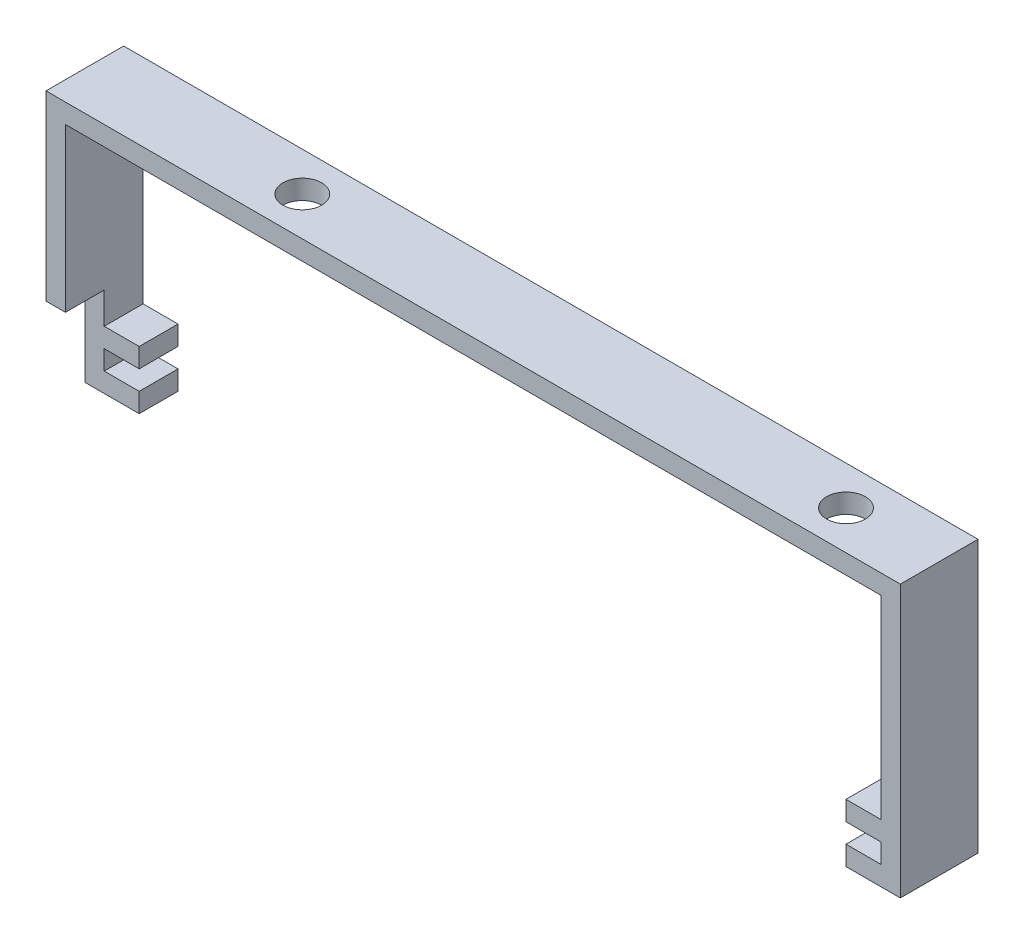
ISO-10303-21;
HEADER;
FILE_DESCRIPTION(('STEP AP214'),'2;1');
FILE_NAME('part.step','',(''),(''),'','','');
FILE_SCHEMA(('AUTOMOTIVE_DESIGN { 1 0 10303 214 1 1 1 1 }'));
ENDSEC;
DATA;
#1=APPLICATION_CONTEXT('core data for automotive mechanical design processes');
#2=APPLICATION_PROTOCOL_DEFINITION('international standard','automotive_design',2000,#1);
#3=PRODUCT_CONTEXT('',#1,'mechanical');
#4=PRODUCT('Part','Part','',(#3));
#5=PRODUCT_RELATED_PRODUCT_CATEGORY('part','',(#4));
#6=PRODUCT_DEFINITION_FORMATION('','',#4);
#7=PRODUCT_DEFINITION_CONTEXT('part definition',#1,'design');
#8=PRODUCT_DEFINITION('design','',#6,#7);
#9=PRODUCT_DEFINITION_SHAPE('','',#8);
#10=(LENGTH_UNIT() NAMED_UNIT(*) SI_UNIT(.MILLI.,.METRE.));
#11=(NAMED_UNIT(*) PLANE_ANGLE_UNIT() SI_UNIT($,.RADIAN.));
#12=(NAMED_UNIT(*) SI_UNIT($,.STERADIAN.) SOLID_ANGLE_UNIT());
#13=UNCERTAINTY_MEASURE_WITH_UNIT(LENGTH_MEASURE(1.E-05),#10,'distance_accuracy_value','');
#14=(GEOMETRIC_REPRESENTATION_CONTEXT(3) GLOBAL_UNCERTAINTY_ASSIGNED_CONTEXT((#13)) GLOBAL_UNIT_ASSIGNED_CONTEXT((#10,
#11,#12)) REPRESENTATION_CONTEXT('',''));
#15=CARTESIAN_POINT('',(0.,0.,0.));
#16=DIRECTION('',(0.,0.,1.));
#17=DIRECTION('',(1.,0.,0.));
#18=AXIS2_PLACEMENT_3D('',#15,#16,#17);
#19=CARTESIAN_POINT('',(0.,-32.5,10.));
#20=DIRECTION('',(1.,0.,0.));
#21=DIRECTION('',(0.,1.,0.));
#22=AXIS2_PLACEMENT_3D('',#19,#20,#21);
#23=PLANE('',#22);
#24=DIRECTION('',(0.,-1.,0.));
#25=VECTOR('',#24,1.);
#26=CARTESIAN_POINT('',(0.,-35.,5.));
#27=LINE('',#26,#25);
#28=CARTESIAN_POINT('',(0.,-23.4498932257555,5.));
#29=VERTEX_POINT('',#28);
#30=CARTESIAN_POINT('',(0.,-35.,5.));
#31=VERTEX_POINT('',#30);
#32=EDGE_CURVE('E343',#29,#31,#27,.T.);
#33=ORIENTED_EDGE('',*,*,#32,.F.);
#34=DIRECTION('',(0.,0.,1.));
#35=VECTOR('',#34,1.);
#36=CARTESIAN_POINT('',(0.,-23.4498932257555,5.));
#37=LINE('',#36,#35);
#38=CARTESIAN_POINT('',(0.,-23.4498932257555,10.));
#39=VERTEX_POINT('',#38);
#40=EDGE_CURVE('E335',#29,#39,#37,.T.);
#41=ORIENTED_EDGE('',*,*,#40,.T.);
#42=DIRECTION('',(0.,-1.,0.));
#43=VECTOR('',#42,1.);
#44=CARTESIAN_POINT('',(0.,0.,10.));
#45=LINE('',#44,#43);
#46=CARTESIAN_POINT('',(0.,0.,10.));
#47=VERTEX_POINT('',#46);
#48=EDGE_CURVE('E266',#47,#39,#45,.T.);
#49=ORIENTED_EDGE('',*,*,#48,.F.);
#50=DIRECTION('',(0.,0.,-1.));
#51=VECTOR('',#50,1.);
#52=CARTESIAN_POINT('',(0.,0.,10.));
#53=LINE('',#52,#51);
#54=CARTESIAN_POINT('',(0.,0.,0.));
#55=VERTEX_POINT('',#54);
#56=EDGE_CURVE('E196',#47,#55,#53,.T.);
#57=ORIENTED_EDGE('',*,*,#56,.T.);
#58=DIRECTION('',(0.,-1.,0.));
#59=VECTOR('',#58,1.);
#60=CARTESIAN_POINT('',(0.,-32.5,0.));
#61=LINE('',#60,#59);
#62=CARTESIAN_POINT('',(0.,-35.,0.));
#63=VERTEX_POINT('',#62);
#64=EDGE_CURVE('E132',#55,#63,#61,.T.);
#65=ORIENTED_EDGE('',*,*,#64,.T.);
#66=DIRECTION('',(0.,0.,-1.));
#67=VECTOR('',#66,1.);
#68=CARTESIAN_POINT('',(0.,-35.,10.));
#69=LINE('',#68,#67);
#70=EDGE_CURVE('E327',#31,#63,#69,.T.);
#71=ORIENTED_EDGE('',*,*,#70,.F.);
#72=EDGE_LOOP('',(#33,#41,#49,#57,#65,#71));
#73=FACE_BOUND('',#72,.T.);
#74=ADVANCED_FACE('F38',(#73),#23,.F.);
#75=CARTESIAN_POINT('',(0.,-35.,10.));
#76=DIRECTION('',(0.,1.,0.));
#77=DIRECTION('',(0.,0.,1.));
#78=AXIS2_PLACEMENT_3D('',#75,#76,#77);
#79=PLANE('',#78);
#80=DIRECTION('',(0.,0.,-1.));
#81=VECTOR('',#80,1.);
#82=CARTESIAN_POINT('',(7.,-35.,10.));
#83=LINE('',#82,#81);
#84=CARTESIAN_POINT('',(7.,-35.,5.));
#85=VERTEX_POINT('',#84);
#86=CARTESIAN_POINT('',(7.,-35.,0.));
#87=VERTEX_POINT('',#86);
#88=EDGE_CURVE('E324',#85,#87,#83,.T.);
#89=ORIENTED_EDGE('',*,*,#88,.F.);
#90=DIRECTION('',(1.,0.,0.));
#91=VECTOR('',#90,1.);
#92=CARTESIAN_POINT('',(0.,-35.,5.));
#93=LINE('',#92,#91);
#94=EDGE_CURVE('E396',#31,#85,#93,.T.);
#95=ORIENTED_EDGE('',*,*,#94,.F.);
#96=ORIENTED_EDGE('',*,*,#70,.T.);
#97=DIRECTION('',(1.,0.,0.));
#98=VECTOR('',#97,1.);
#99=CARTESIAN_POINT('',(0.,-35.,0.));
#100=LINE('',#99,#98);
#101=EDGE_CURVE('E202',#63,#87,#100,.T.);
#102=ORIENTED_EDGE('',*,*,#101,.T.);
#103=EDGE_LOOP('',(#89,#95,#96,#102));
#104=FACE_BOUND('',#103,.T.);
#105=ADVANCED_FACE('F392',(#104),#79,.F.);
#106=CARTESIAN_POINT('',(7.,-32.5,10.));
#107=DIRECTION('',(-1.,0.,0.));
#108=DIRECTION('',(0.,0.,1.));
#109=AXIS2_PLACEMENT_3D('',#106,#107,#108);
#110=PLANE('',#109);
#111=DIRECTION('',(0.,0.,-1.));
#112=VECTOR('',#111,1.);
#113=CARTESIAN_POINT('',(7.,-32.5,10.));
#114=LINE('',#113,#112);
#115=CARTESIAN_POINT('',(7.,-32.5,5.));
#116=VERTEX_POINT('',#115);
#117=CARTESIAN_POINT('',(7.,-32.5,0.));
#118=VERTEX_POINT('',#117);
#119=EDGE_CURVE('E321',#116,#118,#114,.T.);
#120=ORIENTED_EDGE('',*,*,#119,.F.);
#121=DIRECTION('',(0.,-1.,0.));
#122=VECTOR('',#121,1.);
#123=CARTESIAN_POINT('',(7.,-32.5,5.));
#124=LINE('',#123,#122);
#125=EDGE_CURVE('E203',#116,#85,#124,.T.);
#126=ORIENTED_EDGE('',*,*,#125,.T.);
#127=ORIENTED_EDGE('',*,*,#88,.T.);
#128=DIRECTION('',(0.,1.,0.));
#129=VECTOR('',#128,1.);
#130=CARTESIAN_POINT('',(7.,-32.5,0.));
#131=LINE('',#130,#129);
#132=EDGE_CURVE('E207',#87,#118,#131,.T.);
#133=ORIENTED_EDGE('',*,*,#132,.T.);
#134=EDGE_LOOP('',(#120,#126,#127,#133));
#135=FACE_BOUND('',#134,.T.);
#136=ADVANCED_FACE('F437',(#135),#110,.F.);
#137=CARTESIAN_POINT('',(2.5,-32.5,10.));
#138=DIRECTION('',(0.,-1.,0.));
#139=DIRECTION('',(0.,0.,-1.));
#140=AXIS2_PLACEMENT_3D('',#137,#138,#139);
#141=PLANE('',#140);
#142=DIRECTION('',(0.,0.,-1.));
#143=VECTOR('',#142,1.);
#144=CARTESIAN_POINT('',(2.5,-32.5,10.));
#145=LINE('',#144,#143);
#146=CARTESIAN_POINT('',(2.5,-32.5,5.));
#147=VERTEX_POINT('',#146);
#148=CARTESIAN_POINT('',(2.5,-32.5,0.));
#149=VERTEX_POINT('',#148);
#150=EDGE_CURVE('E318',#147,#149,#145,.T.);
#151=ORIENTED_EDGE('',*,*,#150,.F.);
#152=DIRECTION('',(1.,0.,0.));
#153=VECTOR('',#152,1.);
#154=CARTESIAN_POINT('',(2.5,-32.5,5.));
#155=LINE('',#154,#153);
#156=EDGE_CURVE('E428',#147,#116,#155,.T.);
#157=ORIENTED_EDGE('',*,*,#156,.T.);
#158=ORIENTED_EDGE('',*,*,#119,.T.);
#159=DIRECTION('',(-1.,0.,0.));
#160=VECTOR('',#159,1.);
#161=CARTESIAN_POINT('',(2.5,-32.5,0.));
#162=LINE('',#161,#160);
#163=EDGE_CURVE('E211',#118,#149,#162,.T.);
#164=ORIENTED_EDGE('',*,*,#163,.T.);
#165=EDGE_LOOP('',(#151,#157,#158,#164));
#166=FACE_BOUND('',#165,.T.);
#167=ADVANCED_FACE('F504',(#166),#141,.F.);
#168=CARTESIAN_POINT('',(2.5,-30.,10.));
#169=DIRECTION('',(-1.,0.,0.));
#170=DIRECTION('',(0.,0.,1.));
#171=AXIS2_PLACEMENT_3D('',#168,#169,#170);
#172=PLANE('',#171);
#173=DIRECTION('',(0.,0.,-1.));
#174=VECTOR('',#173,1.);
#175=CARTESIAN_POINT('',(2.5,-30.,10.));
#176=LINE('',#175,#174);
#177=CARTESIAN_POINT('',(2.5,-30.,5.));
#178=VERTEX_POINT('',#177);
#179=CARTESIAN_POINT('',(2.5,-30.,0.));
#180=VERTEX_POINT('',#179);
#181=EDGE_CURVE('E315',#178,#180,#176,.T.);
#182=ORIENTED_EDGE('',*,*,#181,.F.);
#183=DIRECTION('',(0.,-1.,0.));
#184=VECTOR('',#183,1.);
#185=CARTESIAN_POINT('',(2.5,-30.,5.));
#186=LINE('',#185,#184);
#187=EDGE_CURVE('E425',#178,#147,#186,.T.);
#188=ORIENTED_EDGE('',*,*,#187,.T.);
#189=ORIENTED_EDGE('',*,*,#150,.T.);
#190=DIRECTION('',(0.,1.,0.));
#191=VECTOR('',#190,1.);
#192=CARTESIAN_POINT('',(2.5,-30.,0.));
#193=LINE('',#192,#191);
#194=EDGE_CURVE('E215',#149,#180,#193,.T.);
#195=ORIENTED_EDGE('',*,*,#194,.T.);
#196=EDGE_LOOP('',(#182,#188,#189,#195));
#197=FACE_BOUND('',#196,.T.);
#198=ADVANCED_FACE('F503',(#197),#172,.F.);
#199=CARTESIAN_POINT('',(2.5,-30.,10.));
#200=DIRECTION('',(0.,1.,0.));
#201=DIRECTION('',(0.,0.,1.));
#202=AXIS2_PLACEMENT_3D('',#199,#200,#201);
#203=PLANE('',#202);
#204=DIRECTION('',(0.,0.,-1.));
#205=VECTOR('',#204,1.);
#206=CARTESIAN_POINT('',(7.,-30.,10.));
#207=LINE('',#206,#205);
#208=CARTESIAN_POINT('',(7.,-30.,5.));
#209=VERTEX_POINT('',#208);
#210=CARTESIAN_POINT('',(7.,-30.,0.));
#211=VERTEX_POINT('',#210);
#212=EDGE_CURVE('E312',#209,#211,#207,.T.);
#213=ORIENTED_EDGE('',*,*,#212,.F.);
#214=DIRECTION('',(-1.,0.,0.));
#215=VECTOR('',#214,1.);
#216=CARTESIAN_POINT('',(2.5,-30.,5.));
#217=LINE('',#216,#215);
#218=EDGE_CURVE('E421',#209,#178,#217,.T.);
#219=ORIENTED_EDGE('',*,*,#218,.T.);
#220=ORIENTED_EDGE('',*,*,#181,.T.);
#221=DIRECTION('',(1.,0.,0.));
#222=VECTOR('',#221,1.);
#223=CARTESIAN_POINT('',(2.5,-30.,0.));
#224=LINE('',#223,#222);
#225=EDGE_CURVE('E219',#180,#211,#224,.T.);
#226=ORIENTED_EDGE('',*,*,#225,.T.);
#227=EDGE_LOOP('',(#213,#219,#220,#226));
#228=FACE_BOUND('',#227,.T.);
#229=ADVANCED_FACE('F499',(#228),#203,.F.);
#230=CARTESIAN_POINT('',(7.,-30.,10.));
#231=DIRECTION('',(-1.,0.,0.));
#232=DIRECTION('',(0.,0.,1.));
#233=AXIS2_PLACEMENT_3D('',#230,#231,#232);
#234=PLANE('',#233);
#235=DIRECTION('',(0.,0.,-1.));
#236=VECTOR('',#235,1.);
#237=CARTESIAN_POINT('',(7.,-27.5,10.));
#238=LINE('',#237,#236);
#239=CARTESIAN_POINT('',(7.,-27.5,5.));
#240=VERTEX_POINT('',#239);
#241=CARTESIAN_POINT('',(7.,-27.5,0.));
#242=VERTEX_POINT('',#241);
#243=EDGE_CURVE('E309',#240,#242,#238,.T.);
#244=ORIENTED_EDGE('',*,*,#243,.F.);
#245=DIRECTION('',(0.,-1.,0.));
#246=VECTOR('',#245,1.);
#247=CARTESIAN_POINT('',(7.,-30.,5.));
#248=LINE('',#247,#246);
#249=EDGE_CURVE('E417',#240,#209,#248,.T.);
#250=ORIENTED_EDGE('',*,*,#249,.T.);
#251=ORIENTED_EDGE('',*,*,#212,.T.);
#252=DIRECTION('',(0.,1.,0.));
#253=VECTOR('',#252,1.);
#254=CARTESIAN_POINT('',(7.,-30.,0.));
#255=LINE('',#254,#253);
#256=EDGE_CURVE('E223',#211,#242,#255,.T.);
#257=ORIENTED_EDGE('',*,*,#256,.T.);
#258=EDGE_LOOP('',(#244,#250,#251,#257));
#259=FACE_BOUND('',#258,.T.);
#260=ADVANCED_FACE('F496',(#259),#234,.F.);
#261=CARTESIAN_POINT('',(2.5,-27.5,10.));
#262=DIRECTION('',(0.,-1.,0.));
#263=DIRECTION('',(0.,0.,-1.));
#264=AXIS2_PLACEMENT_3D('',#261,#262,#263);
#265=PLANE('',#264);
#266=DIRECTION('',(0.,0.,-1.));
#267=VECTOR('',#266,1.);
#268=CARTESIAN_POINT('',(2.5,-27.5,10.));
#269=LINE('',#268,#267);
#270=CARTESIAN_POINT('',(2.5,-27.5,5.));
#271=VERTEX_POINT('',#270);
#272=CARTESIAN_POINT('',(2.5,-27.5,0.));
#273=VERTEX_POINT('',#272);
#274=EDGE_CURVE('E306',#271,#273,#269,.T.);
#275=ORIENTED_EDGE('',*,*,#274,.F.);
#276=DIRECTION('',(1.,0.,0.));
#277=VECTOR('',#276,1.);
#278=CARTESIAN_POINT('',(2.5,-27.5,5.));
#279=LINE('',#278,#277);
#280=EDGE_CURVE('E413',#271,#240,#279,.T.);
#281=ORIENTED_EDGE('',*,*,#280,.T.);
#282=ORIENTED_EDGE('',*,*,#243,.T.);
#283=DIRECTION('',(-1.,0.,0.));
#284=VECTOR('',#283,1.);
#285=CARTESIAN_POINT('',(2.5,-27.5,0.));
#286=LINE('',#285,#284);
#287=EDGE_CURVE('E227',#242,#273,#286,.T.);
#288=ORIENTED_EDGE('',*,*,#287,.T.);
#289=EDGE_LOOP('',(#275,#281,#282,#288));
#290=FACE_BOUND('',#289,.T.);
#291=ADVANCED_FACE('F493',(#290),#265,.F.);
#292=CARTESIAN_POINT('',(2.5,-2.5,10.));
#293=DIRECTION('',(-1.,0.,0.));
#294=DIRECTION('',(0.,-1.,0.));
#295=AXIS2_PLACEMENT_3D('',#292,#293,#294);
#296=PLANE('',#295);
#297=DIRECTION('',(0.,1.,0.));
#298=VECTOR('',#297,1.);
#299=CARTESIAN_POINT('',(2.5,-2.5,10.));
#300=LINE('',#299,#298);
#301=CARTESIAN_POINT('',(2.5,-23.4498932257555,10.));
#302=VERTEX_POINT('',#301);
#303=CARTESIAN_POINT('',(2.5,-2.5,10.));
#304=VERTEX_POINT('',#303);
#305=EDGE_CURVE('E139',#302,#304,#300,.T.);
#306=ORIENTED_EDGE('',*,*,#305,.F.);
#307=DIRECTION('',(0.,0.,-1.));
#308=VECTOR('',#307,1.);
#309=CARTESIAN_POINT('',(2.5,-23.4498932257555,10.));
#310=LINE('',#309,#308);
#311=CARTESIAN_POINT('',(2.5,-23.4498932257555,5.));
#312=VERTEX_POINT('',#311);
#313=EDGE_CURVE('E53',#302,#312,#310,.T.);
#314=ORIENTED_EDGE('',*,*,#313,.T.);
#315=DIRECTION('',(0.,-1.,0.));
#316=VECTOR('',#315,1.);
#317=CARTESIAN_POINT('',(2.5,-2.5,5.));
#318=LINE('',#317,#316);
#319=EDGE_CURVE('E11',#312,#271,#318,.T.);
#320=ORIENTED_EDGE('',*,*,#319,.T.);
#321=ORIENTED_EDGE('',*,*,#274,.T.);
#322=DIRECTION('',(0.,1.,0.));
#323=VECTOR('',#322,1.);
#324=CARTESIAN_POINT('',(2.5,-2.5,0.));
#325=LINE('',#324,#323);
#326=CARTESIAN_POINT('',(2.5,-2.5,0.));
#327=VERTEX_POINT('',#326);
#328=EDGE_CURVE('E231',#273,#327,#325,.T.);
#329=ORIENTED_EDGE('',*,*,#328,.T.);
#330=DIRECTION('',(0.,0.,-1.));
#331=VECTOR('',#330,1.);
#332=CARTESIAN_POINT('',(2.5,-2.5,10.));
#333=LINE('',#332,#331);
#334=EDGE_CURVE('E302',#304,#327,#333,.T.);
#335=ORIENTED_EDGE('',*,*,#334,.F.);
#336=EDGE_LOOP('',(#306,#314,#320,#321,#329,#335));
#337=FACE_BOUND('',#336,.T.);
#338=ADVANCED_FACE('F458',(#337),#296,.F.);
#339=CARTESIAN_POINT('',(2.5,-2.5,10.));
#340=DIRECTION('',(0.,1.,0.));
#341=DIRECTION('',(-1.,0.,0.));
#342=AXIS2_PLACEMENT_3D('',#339,#340,#341);
#343=PLANE('',#342);
#344=CARTESIAN_POINT('',(98.,-2.5,5.));
#345=DIRECTION('',(0.,1.,0.));
#346=DIRECTION('',(-1.,0.,0.));
#347=AXIS2_PLACEMENT_3D('',#344,#345,#346);
#348=CIRCLE('',#347,2.5);
#349=CARTESIAN_POINT('',(95.5,-2.5,5.));
#350=VERTEX_POINT('',#349);
#351=EDGE_CURVE('E407',#350,#350,#348,.T.);
#352=ORIENTED_EDGE('',*,*,#351,.T.);
#353=EDGE_LOOP('',(#352));
#354=FACE_BOUND('',#353,.T.);
#355=CARTESIAN_POINT('',(28.,-2.5,5.));
#356=DIRECTION('',(0.,1.,0.));
#357=DIRECTION('',(-1.,0.,0.));
#358=AXIS2_PLACEMENT_3D('',#355,#356,#357);
#359=CIRCLE('',#358,2.50000000000001);
#360=CARTESIAN_POINT('',(25.5,-2.5,5.));
#361=VERTEX_POINT('',#360);
#362=EDGE_CURVE('E700',#361,#361,#359,.T.);
#363=ORIENTED_EDGE('',*,*,#362,.T.);
#364=EDGE_LOOP('',(#363));
#365=FACE_BOUND('',#364,.T.);
#366=DIRECTION('',(1.,0.,0.));
#367=VECTOR('',#366,1.);
#368=CARTESIAN_POINT('',(2.5,-2.5,0.));
#369=LINE('',#368,#367);
#370=CARTESIAN_POINT('',(107.5,-2.5,0.));
#371=VERTEX_POINT('',#370);
#372=EDGE_CURVE('E234',#327,#371,#369,.T.);
#373=ORIENTED_EDGE('',*,*,#372,.T.);
#374=DIRECTION('',(0.,0.,-1.));
#375=VECTOR('',#374,1.);
#376=CARTESIAN_POINT('',(107.5,-2.5,10.));
#377=LINE('',#376,#375);
#378=CARTESIAN_POINT('',(107.5,-2.5,10.));
#379=VERTEX_POINT('',#378);
#380=EDGE_CURVE('E298',#379,#371,#377,.T.);
#381=ORIENTED_EDGE('',*,*,#380,.F.);
#382=DIRECTION('',(1.,0.,0.));
#383=VECTOR('',#382,1.);
#384=CARTESIAN_POINT('',(2.5,-2.5,10.));
#385=LINE('',#384,#383);
#386=EDGE_CURVE('E350',#304,#379,#385,.T.);
#387=ORIENTED_EDGE('',*,*,#386,.F.);
#388=ORIENTED_EDGE('',*,*,#334,.T.);
#389=EDGE_LOOP('',(#373,#381,#387,#388));
#390=FACE_BOUND('',#389,.T.);
#391=ADVANCED_FACE('F465',(#354,#365,#390),#343,.F.);
#392=CARTESIAN_POINT('',(107.5,-2.5,10.));
#393=DIRECTION('',(1.,0.,0.));
#394=DIRECTION('',(0.,1.,0.));
#395=AXIS2_PLACEMENT_3D('',#392,#393,#394);
#396=PLANE('',#395);
#397=DIRECTION('',(0.,-1.,0.));
#398=VECTOR('',#397,1.);
#399=CARTESIAN_POINT('',(107.5,-2.5,0.));
#400=LINE('',#399,#398);
#401=CARTESIAN_POINT('',(107.5,-27.5,0.));
#402=VERTEX_POINT('',#401);
#403=EDGE_CURVE('E237',#371,#402,#400,.T.);
#404=ORIENTED_EDGE('',*,*,#403,.T.);
#405=DIRECTION('',(0.,0.,-1.));
#406=VECTOR('',#405,1.);
#407=CARTESIAN_POINT('',(107.5,-27.5,10.));
#408=LINE('',#407,#406);
#409=CARTESIAN_POINT('',(107.5,-27.5,10.));
#410=VERTEX_POINT('',#409);
#411=EDGE_CURVE('E294',#410,#402,#408,.T.);
#412=ORIENTED_EDGE('',*,*,#411,.F.);
#413=DIRECTION('',(0.,-1.,0.));
#414=VECTOR('',#413,1.);
#415=CARTESIAN_POINT('',(107.5,-2.5,10.));
#416=LINE('',#415,#414);
#417=EDGE_CURVE('E357',#379,#410,#416,.T.);
#418=ORIENTED_EDGE('',*,*,#417,.F.);
#419=ORIENTED_EDGE('',*,*,#380,.T.);
#420=EDGE_LOOP('',(#404,#412,#418,#419));
#421=FACE_BOUND('',#420,.T.);
#422=ADVANCED_FACE('F471',(#421),#396,.F.);
#423=CARTESIAN_POINT('',(107.5,-27.5,10.));
#424=DIRECTION('',(0.,-1.,0.));
#425=DIRECTION('',(0.,0.,-1.));
#426=AXIS2_PLACEMENT_3D('',#423,#424,#425);
#427=PLANE('',#426);
#428=DIRECTION('',(-1.,0.,0.));
#429=VECTOR('',#428,1.);
#430=CARTESIAN_POINT('',(107.5,-27.5,0.));
#431=LINE('',#430,#429);
#432=CARTESIAN_POINT('',(103.,-27.5,0.));
#433=VERTEX_POINT('',#432);
#434=EDGE_CURVE('E240',#402,#433,#431,.T.);
#435=ORIENTED_EDGE('',*,*,#434,.T.);
#436=DIRECTION('',(0.,0.,-1.));
#437=VECTOR('',#436,1.);
#438=CARTESIAN_POINT('',(103.,-27.5,10.));
#439=LINE('',#438,#437);
#440=CARTESIAN_POINT('',(103.,-27.5,10.));
#441=VERTEX_POINT('',#440);
#442=EDGE_CURVE('E290',#441,#433,#439,.T.);
#443=ORIENTED_EDGE('',*,*,#442,.F.);
#444=DIRECTION('',(-1.,0.,0.));
#445=VECTOR('',#444,1.);
#446=CARTESIAN_POINT('',(107.5,-27.5,10.));
#447=LINE('',#446,#445);
#448=EDGE_CURVE('E360',#410,#441,#447,.T.);
#449=ORIENTED_EDGE('',*,*,#448,.F.);
#450=ORIENTED_EDGE('',*,*,#411,.T.);
#451=EDGE_LOOP('',(#435,#443,#449,#450));
#452=FACE_BOUND('',#451,.T.);
#453=ADVANCED_FACE('F475',(#452),#427,.F.);
#454=CARTESIAN_POINT('',(103.,-27.5,10.));
#455=DIRECTION('',(1.,0.,0.));
#456=DIRECTION('',(0.,0.,-1.));
#457=AXIS2_PLACEMENT_3D('',#454,#455,#456);
#458=PLANE('',#457);
#459=DIRECTION('',(0.,-1.,0.));
#460=VECTOR('',#459,1.);
#461=CARTESIAN_POINT('',(103.,-27.5,0.));
#462=LINE('',#461,#460);
#463=CARTESIAN_POINT('',(103.,-30.,0.));
#464=VERTEX_POINT('',#463);
#465=EDGE_CURVE('E243',#433,#464,#462,.T.);
#466=ORIENTED_EDGE('',*,*,#465,.T.);
#467=DIRECTION('',(0.,0.,-1.));
#468=VECTOR('',#467,1.);
#469=CARTESIAN_POINT('',(103.,-30.,10.));
#470=LINE('',#469,#468);
#471=CARTESIAN_POINT('',(103.,-30.,10.));
#472=VERTEX_POINT('',#471);
#473=EDGE_CURVE('E286',#472,#464,#470,.T.);
#474=ORIENTED_EDGE('',*,*,#473,.F.);
#475=DIRECTION('',(0.,-1.,0.));
#476=VECTOR('',#475,1.);
#477=CARTESIAN_POINT('',(103.,-27.5,10.));
#478=LINE('',#477,#476);
#479=EDGE_CURVE('E363',#441,#472,#478,.T.);
#480=ORIENTED_EDGE('',*,*,#479,.F.);
#481=ORIENTED_EDGE('',*,*,#442,.T.);
#482=EDGE_LOOP('',(#466,#474,#480,#481));
#483=FACE_BOUND('',#482,.T.);
#484=ADVANCED_FACE('F480',(#483),#458,.F.);
#485=CARTESIAN_POINT('',(107.5,-30.,10.));
#486=DIRECTION('',(0.,1.,0.));
#487=DIRECTION('',(0.,0.,1.));
#488=AXIS2_PLACEMENT_3D('',#485,#486,#487);
#489=PLANE('',#488);
#490=DIRECTION('',(1.,0.,0.));
#491=VECTOR('',#490,1.);
#492=CARTESIAN_POINT('',(107.5,-30.,0.));
#493=LINE('',#492,#491);
#494=CARTESIAN_POINT('',(107.5,-30.,0.));
#495=VERTEX_POINT('',#494);
#496=EDGE_CURVE('E246',#464,#495,#493,.T.);
#497=ORIENTED_EDGE('',*,*,#496,.T.);
#498=DIRECTION('',(0.,0.,-1.));
#499=VECTOR('',#498,1.);
#500=CARTESIAN_POINT('',(107.5,-30.,10.));
#501=LINE('',#500,#499);
#502=CARTESIAN_POINT('',(107.5,-30.,10.));
#503=VERTEX_POINT('',#502);
#504=EDGE_CURVE('E282',#503,#495,#501,.T.);
#505=ORIENTED_EDGE('',*,*,#504,.F.);
#506=DIRECTION('',(1.,0.,0.));
#507=VECTOR('',#506,1.);
#508=CARTESIAN_POINT('',(107.5,-30.,10.));
#509=LINE('',#508,#507);
#510=EDGE_CURVE('E366',#472,#503,#509,.T.);
#511=ORIENTED_EDGE('',*,*,#510,.F.);
#512=ORIENTED_EDGE('',*,*,#473,.T.);
#513=EDGE_LOOP('',(#497,#505,#511,#512));
#514=FACE_BOUND('',#513,.T.);
#515=ADVANCED_FACE('F484',(#514),#489,.F.);
#516=CARTESIAN_POINT('',(107.5,-30.,10.));
#517=DIRECTION('',(1.,0.,0.));
#518=DIRECTION('',(0.,0.,-1.));
#519=AXIS2_PLACEMENT_3D('',#516,#517,#518);
#520=PLANE('',#519);
#521=DIRECTION('',(0.,-1.,0.));
#522=VECTOR('',#521,1.);
#523=CARTESIAN_POINT('',(107.5,-30.,0.));
#524=LINE('',#523,#522);
#525=CARTESIAN_POINT('',(107.5,-32.5,0.));
#526=VERTEX_POINT('',#525);
#527=EDGE_CURVE('E249',#495,#526,#524,.T.);
#528=ORIENTED_EDGE('',*,*,#527,.T.);
#529=DIRECTION('',(0.,0.,-1.));
#530=VECTOR('',#529,1.);
#531=CARTESIAN_POINT('',(107.5,-32.5,10.));
#532=LINE('',#531,#530);
#533=CARTESIAN_POINT('',(107.5,-32.5,10.));
#534=VERTEX_POINT('',#533);
#535=EDGE_CURVE('E278',#534,#526,#532,.T.);
#536=ORIENTED_EDGE('',*,*,#535,.F.);
#537=DIRECTION('',(0.,-1.,0.));
#538=VECTOR('',#537,1.);
#539=CARTESIAN_POINT('',(107.5,-30.,10.));
#540=LINE('',#539,#538);
#541=EDGE_CURVE('E369',#503,#534,#540,.T.);
#542=ORIENTED_EDGE('',*,*,#541,.F.);
#543=ORIENTED_EDGE('',*,*,#504,.T.);
#544=EDGE_LOOP('',(#528,#536,#542,#543));
#545=FACE_BOUND('',#544,.T.);
#546=ADVANCED_FACE('F488',(#545),#520,.F.);
#547=CARTESIAN_POINT('',(107.5,-32.5,10.));
#548=DIRECTION('',(0.,-1.,0.));
#549=DIRECTION('',(0.,0.,-1.));
#550=AXIS2_PLACEMENT_3D('',#547,#548,#549);
#551=PLANE('',#550);
#552=DIRECTION('',(-1.,0.,0.));
#553=VECTOR('',#552,1.);
#554=CARTESIAN_POINT('',(107.5,-32.5,0.));
#555=LINE('',#554,#553);
#556=CARTESIAN_POINT('',(103.,-32.5,0.));
#557=VERTEX_POINT('',#556);
#558=EDGE_CURVE('E252',#526,#557,#555,.T.);
#559=ORIENTED_EDGE('',*,*,#558,.T.);
#560=DIRECTION('',(0.,0.,-1.));
#561=VECTOR('',#560,1.);
#562=CARTESIAN_POINT('',(103.,-32.5,10.));
#563=LINE('',#562,#561);
#564=CARTESIAN_POINT('',(103.,-32.5,10.));
#565=VERTEX_POINT('',#564);
#566=EDGE_CURVE('E274',#565,#557,#563,.T.);
#567=ORIENTED_EDGE('',*,*,#566,.F.);
#568=DIRECTION('',(-1.,0.,0.));
#569=VECTOR('',#568,1.);
#570=CARTESIAN_POINT('',(107.5,-32.5,10.));
#571=LINE('',#570,#569);
#572=EDGE_CURVE('E372',#534,#565,#571,.T.);
#573=ORIENTED_EDGE('',*,*,#572,.F.);
#574=ORIENTED_EDGE('',*,*,#535,.T.);
#575=EDGE_LOOP('',(#559,#567,#573,#574));
#576=FACE_BOUND('',#575,.T.);
#577=ADVANCED_FACE('F380',(#576),#551,.F.);
#578=CARTESIAN_POINT('',(103.,-32.5,10.));
#579=DIRECTION('',(1.,0.,0.));
#580=DIRECTION('',(0.,0.,-1.));
#581=AXIS2_PLACEMENT_3D('',#578,#579,#580);
#582=PLANE('',#581);
#583=DIRECTION('',(0.,-1.,0.));
#584=VECTOR('',#583,1.);
#585=CARTESIAN_POINT('',(103.,-32.5,0.));
#586=LINE('',#585,#584);
#587=CARTESIAN_POINT('',(103.,-35.,0.));
#588=VERTEX_POINT('',#587);
#589=EDGE_CURVE('E255',#557,#588,#586,.T.);
#590=ORIENTED_EDGE('',*,*,#589,.T.);
#591=DIRECTION('',(0.,0.,-1.));
#592=VECTOR('',#591,1.);
#593=CARTESIAN_POINT('',(103.,-35.,10.));
#594=LINE('',#593,#592);
#595=CARTESIAN_POINT('',(103.,-35.,10.));
#596=VERTEX_POINT('',#595);
#597=EDGE_CURVE('E188',#596,#588,#594,.T.);
#598=ORIENTED_EDGE('',*,*,#597,.F.);
#599=DIRECTION('',(0.,-1.,0.));
#600=VECTOR('',#599,1.);
#601=CARTESIAN_POINT('',(103.,-32.5,10.));
#602=LINE('',#601,#600);
#603=EDGE_CURVE('E174',#565,#596,#602,.T.);
#604=ORIENTED_EDGE('',*,*,#603,.F.);
#605=ORIENTED_EDGE('',*,*,#566,.T.);
#606=EDGE_LOOP('',(#590,#598,#604,#605));
#607=FACE_BOUND('',#606,.T.);
#608=ADVANCED_FACE('F384',(#607),#582,.F.);
#609=CARTESIAN_POINT('',(110.,-35.,10.));
#610=DIRECTION('',(0.,1.,0.));
#611=DIRECTION('',(0.,0.,1.));
#612=AXIS2_PLACEMENT_3D('',#609,#610,#611);
#613=PLANE('',#612);
#614=DIRECTION('',(1.,0.,0.));
#615=VECTOR('',#614,1.);
#616=CARTESIAN_POINT('',(110.,-35.,0.));
#617=LINE('',#616,#615);
#618=CARTESIAN_POINT('',(110.,-35.,0.));
#619=VERTEX_POINT('',#618);
#620=EDGE_CURVE('E185',#588,#619,#617,.T.);
#621=ORIENTED_EDGE('',*,*,#620,.T.);
#622=DIRECTION('',(0.,0.,-1.));
#623=VECTOR('',#622,1.);
#624=CARTESIAN_POINT('',(110.,-35.,10.));
#625=LINE('',#624,#623);
#626=CARTESIAN_POINT('',(110.,-35.,10.));
#627=VERTEX_POINT('',#626);
#628=EDGE_CURVE('E182',#627,#619,#625,.T.);
#629=ORIENTED_EDGE('',*,*,#628,.F.);
#630=DIRECTION('',(1.,0.,0.));
#631=VECTOR('',#630,1.);
#632=CARTESIAN_POINT('',(110.,-35.,10.));
#633=LINE('',#632,#631);
#634=EDGE_CURVE('E167',#596,#627,#633,.T.);
#635=ORIENTED_EDGE('',*,*,#634,.F.);
#636=ORIENTED_EDGE('',*,*,#597,.T.);
#637=EDGE_LOOP('',(#621,#629,#635,#636));
#638=FACE_BOUND('',#637,.T.);
#639=ADVANCED_FACE('F183',(#638),#613,.F.);
#640=CARTESIAN_POINT('',(110.,0.,10.));
#641=DIRECTION('',(-1.,0.,0.));
#642=DIRECTION('',(0.,0.,1.));
#643=AXIS2_PLACEMENT_3D('',#640,#641,#642);
#644=PLANE('',#643);
#645=DIRECTION('',(0.,1.,0.));
#646=VECTOR('',#645,1.);
#647=CARTESIAN_POINT('',(110.,0.,0.));
#648=LINE('',#647,#646);
#649=CARTESIAN_POINT('',(110.,0.,0.));
#650=VERTEX_POINT('',#649);
#651=EDGE_CURVE('E260',#619,#650,#648,.T.);
#652=ORIENTED_EDGE('',*,*,#651,.T.);
#653=DIRECTION('',(0.,0.,-1.));
#654=VECTOR('',#653,1.);
#655=CARTESIAN_POINT('',(110.,0.,10.));
#656=LINE('',#655,#654);
#657=CARTESIAN_POINT('',(110.,0.,10.));
#658=VERTEX_POINT('',#657);
#659=EDGE_CURVE('E189',#658,#650,#656,.T.);
#660=ORIENTED_EDGE('',*,*,#659,.F.);
#661=DIRECTION('',(0.,1.,0.));
#662=VECTOR('',#661,1.);
#663=CARTESIAN_POINT('',(110.,-32.5,10.));
#664=LINE('',#663,#662);
#665=EDGE_CURVE('E171',#627,#658,#664,.T.);
#666=ORIENTED_EDGE('',*,*,#665,.F.);
#667=ORIENTED_EDGE('',*,*,#628,.T.);
#668=EDGE_LOOP('',(#652,#660,#666,#667));
#669=FACE_BOUND('',#668,.T.);
#670=ADVANCED_FACE('F191',(#669),#644,.F.);
#671=CARTESIAN_POINT('',(0.,0.,10.));
#672=DIRECTION('',(0.,-1.,0.));
#673=DIRECTION('',(0.,0.,-1.));
#674=AXIS2_PLACEMENT_3D('',#671,#672,#673);
#675=PLANE('',#674);
#676=CARTESIAN_POINT('',(98.,0.,5.));
#677=DIRECTION('',(0.,1.,0.));
#678=DIRECTION('',(0.,0.,1.));
#679=AXIS2_PLACEMENT_3D('',#676,#677,#678);
#680=CIRCLE('',#679,2.5);
#681=CARTESIAN_POINT('',(98.,0.,7.5));
#682=VERTEX_POINT('',#681);
#683=EDGE_CURVE('E696',#682,#682,#680,.T.);
#684=ORIENTED_EDGE('',*,*,#683,.F.);
#685=EDGE_LOOP('',(#684));
#686=FACE_BOUND('',#685,.T.);
#687=CARTESIAN_POINT('',(28.,0.,5.));
#688=DIRECTION('',(0.,1.,0.));
#689=DIRECTION('',(0.,0.,1.));
#690=AXIS2_PLACEMENT_3D('',#687,#688,#689);
#691=CIRCLE('',#690,2.50000000000001);
#692=CARTESIAN_POINT('',(28.,0.,7.50000000000001));
#693=VERTEX_POINT('',#692);
#694=EDGE_CURVE('E705',#693,#693,#691,.T.);
#695=ORIENTED_EDGE('',*,*,#694,.F.);
#696=EDGE_LOOP('',(#695));
#697=FACE_BOUND('',#696,.T.);
#698=DIRECTION('',(-1.,0.,0.));
#699=VECTOR('',#698,1.);
#700=CARTESIAN_POINT('',(0.,0.,0.));
#701=LINE('',#700,#699);
#702=EDGE_CURVE('E263',#650,#55,#701,.T.);
#703=ORIENTED_EDGE('',*,*,#702,.T.);
#704=ORIENTED_EDGE('',*,*,#56,.F.);
#705=DIRECTION('',(-1.,0.,0.));
#706=VECTOR('',#705,1.);
#707=CARTESIAN_POINT('',(0.,0.,10.));
#708=LINE('',#707,#706);
#709=EDGE_CURVE('E62',#658,#47,#708,.T.);
#710=ORIENTED_EDGE('',*,*,#709,.F.);
#711=ORIENTED_EDGE('',*,*,#659,.T.);
#712=EDGE_LOOP('',(#703,#704,#710,#711));
#713=FACE_BOUND('',#712,.T.);
#714=ADVANCED_FACE('F387',(#686,#697,#713),#675,.F.);
#715=CARTESIAN_POINT('',(0.,0.,10.));
#716=DIRECTION('',(0.,0.,1.));
#717=DIRECTION('',(1.,0.,0.));
#718=AXIS2_PLACEMENT_3D('',#715,#716,#717);
#719=PLANE('',#718);
#720=DIRECTION('',(-1.,0.,0.));
#721=VECTOR('',#720,1.);
#722=CARTESIAN_POINT('',(0.,-23.4498932257555,10.));
#723=LINE('',#722,#721);
#724=EDGE_CURVE('E46',#302,#39,#723,.T.);
#725=ORIENTED_EDGE('',*,*,#724,.F.);
#726=ORIENTED_EDGE('',*,*,#305,.T.);
#727=ORIENTED_EDGE('',*,*,#386,.T.);
#728=ORIENTED_EDGE('',*,*,#417,.T.);
#729=ORIENTED_EDGE('',*,*,#448,.T.);
#730=ORIENTED_EDGE('',*,*,#479,.T.);
#731=ORIENTED_EDGE('',*,*,#510,.T.);
#732=ORIENTED_EDGE('',*,*,#541,.T.);
#733=ORIENTED_EDGE('',*,*,#572,.T.);
#734=ORIENTED_EDGE('',*,*,#603,.T.);
#735=ORIENTED_EDGE('',*,*,#634,.T.);
#736=ORIENTED_EDGE('',*,*,#665,.T.);
#737=ORIENTED_EDGE('',*,*,#709,.T.);
#738=ORIENTED_EDGE('',*,*,#48,.T.);
#739=EDGE_LOOP('',(#725,#726,#727,#728,#729,#730,#731,#732,#733,#734,#735,#736,#737,#738));
#740=FACE_BOUND('',#739,.T.);
#741=ADVANCED_FACE('F169',(#740),#719,.T.);
#742=CARTESIAN_POINT('',(0.,0.,0.));
#743=DIRECTION('',(0.,0.,1.));
#744=DIRECTION('',(1.,0.,0.));
#745=AXIS2_PLACEMENT_3D('',#742,#743,#744);
#746=PLANE('',#745);
#747=ORIENTED_EDGE('',*,*,#64,.F.);
#748=ORIENTED_EDGE('',*,*,#702,.F.);
#749=ORIENTED_EDGE('',*,*,#651,.F.);
#750=ORIENTED_EDGE('',*,*,#620,.F.);
#751=ORIENTED_EDGE('',*,*,#589,.F.);
#752=ORIENTED_EDGE('',*,*,#558,.F.);
#753=ORIENTED_EDGE('',*,*,#527,.F.);
#754=ORIENTED_EDGE('',*,*,#496,.F.);
#755=ORIENTED_EDGE('',*,*,#465,.F.);
#756=ORIENTED_EDGE('',*,*,#434,.F.);
#757=ORIENTED_EDGE('',*,*,#403,.F.);
#758=ORIENTED_EDGE('',*,*,#372,.F.);
#759=ORIENTED_EDGE('',*,*,#328,.F.);
#760=ORIENTED_EDGE('',*,*,#287,.F.);
#761=ORIENTED_EDGE('',*,*,#256,.F.);
#762=ORIENTED_EDGE('',*,*,#225,.F.);
#763=ORIENTED_EDGE('',*,*,#194,.F.);
#764=ORIENTED_EDGE('',*,*,#163,.F.);
#765=ORIENTED_EDGE('',*,*,#132,.F.);
#766=ORIENTED_EDGE('',*,*,#101,.F.);
#767=EDGE_LOOP('',(#747,#748,#749,#750,#751,#752,#753,#754,#755,#756,#757,#758,#759,#760,#761,
#762,#763,#764,#765,#766));
#768=FACE_BOUND('',#767,.T.);
#769=ADVANCED_FACE('F385',(#768),#746,.F.);
#770=CARTESIAN_POINT('',(0.,0.,5.));
#771=DIRECTION('',(0.,0.,-1.));
#772=DIRECTION('',(-1.,0.,0.));
#773=AXIS2_PLACEMENT_3D('',#770,#771,#772);
#774=PLANE('',#773);
#775=ORIENTED_EDGE('',*,*,#156,.F.);
#776=ORIENTED_EDGE('',*,*,#187,.F.);
#777=ORIENTED_EDGE('',*,*,#218,.F.);
#778=ORIENTED_EDGE('',*,*,#249,.F.);
#779=ORIENTED_EDGE('',*,*,#280,.F.);
#780=ORIENTED_EDGE('',*,*,#319,.F.);
#781=DIRECTION('',(-1.,0.,0.));
#782=VECTOR('',#781,1.);
#783=CARTESIAN_POINT('',(0.,-23.4498932257555,5.));
#784=LINE('',#783,#782);
#785=EDGE_CURVE('E345',#312,#29,#784,.T.);
#786=ORIENTED_EDGE('',*,*,#785,.T.);
#787=ORIENTED_EDGE('',*,*,#32,.T.);
#788=ORIENTED_EDGE('',*,*,#94,.T.);
#789=ORIENTED_EDGE('',*,*,#125,.F.);
#790=EDGE_LOOP('',(#775,#776,#777,#778,#779,#780,#786,#787,#788,#789));
#791=FACE_BOUND('',#790,.T.);
#792=ADVANCED_FACE('F440',(#791),#774,.F.);
#793=CARTESIAN_POINT('',(0.,-23.4498932257555,5.));
#794=DIRECTION('',(0.,1.,0.));
#795=DIRECTION('',(0.,0.,1.));
#796=AXIS2_PLACEMENT_3D('',#793,#794,#795);
#797=PLANE('',#796);
#798=ORIENTED_EDGE('',*,*,#724,.T.);
#799=ORIENTED_EDGE('',*,*,#40,.F.);
#800=ORIENTED_EDGE('',*,*,#785,.F.);
#801=ORIENTED_EDGE('',*,*,#313,.F.);
#802=EDGE_LOOP('',(#798,#799,#800,#801));
#803=FACE_BOUND('',#802,.T.);
#804=ADVANCED_FACE('F333',(#803),#797,.F.);
#805=CARTESIAN_POINT('',(28.,-3.,5.));
#806=DIRECTION('',(0.,1.,0.));
#807=DIRECTION('',(0.,0.,1.));
#808=AXIS2_PLACEMENT_3D('',#805,#806,#807);
#809=CYLINDRICAL_SURFACE('',#808,2.50000000000001);
#810=ORIENTED_EDGE('',*,*,#694,.T.);
#811=EDGE_LOOP('',(#810));
#812=FACE_BOUND('',#811,.T.);
#813=ORIENTED_EDGE('',*,*,#362,.F.);
#814=EDGE_LOOP('',(#813));
#815=FACE_BOUND('',#814,.T.);
#816=ADVANCED_FACE('F666',(#812,#815),#809,.F.);
#817=CARTESIAN_POINT('',(98.,-3.,5.));
#818=DIRECTION('',(0.,1.,0.));
#819=DIRECTION('',(0.,0.,1.));
#820=AXIS2_PLACEMENT_3D('',#817,#818,#819);
#821=CYLINDRICAL_SURFACE('',#820,2.5);
#822=ORIENTED_EDGE('',*,*,#683,.T.);
#823=EDGE_LOOP('',(#822));
#824=FACE_BOUND('',#823,.T.);
#825=ORIENTED_EDGE('',*,*,#351,.F.);
#826=EDGE_LOOP('',(#825));
#827=FACE_BOUND('',#826,.T.);
#828=ADVANCED_FACE('F672',(#824,#827),#821,.F.);
#829=CLOSED_SHELL('',(#74,#105,#136,#167,#198,#229,#260,#291,#338,#391,#422,#453,#484,#515,#546,
#577,#608,#639,#670,#714,#741,#769,#792,#804,#816,#828));
#830=MANIFOLD_SOLID_BREP('B2',#829);
#831=ADVANCED_BREP_SHAPE_REPRESENTATION('',(#18,#830),#14);
#832=SHAPE_DEFINITION_REPRESENTATION(#9,#831);
ENDSEC;
END-ISO-10303-21;
